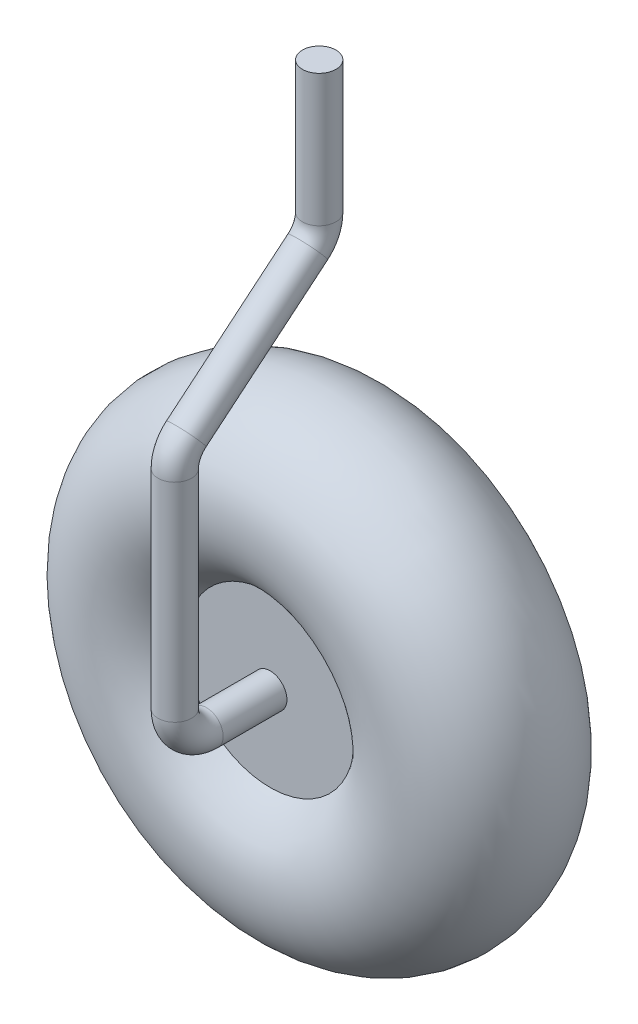
ISO-10303-21;
HEADER;
FILE_DESCRIPTION(('STEP AP214'),'2;1');
FILE_NAME('part.step','',(''),(''),'','','');
FILE_SCHEMA(('AUTOMOTIVE_DESIGN { 1 0 10303 214 1 1 1 1 }'));
ENDSEC;
DATA;
#1=APPLICATION_CONTEXT('core data for automotive mechanical design processes');
#2=APPLICATION_PROTOCOL_DEFINITION('international standard','automotive_design',2000,#1);
#3=PRODUCT_CONTEXT('',#1,'mechanical');
#4=PRODUCT('Part','Part','',(#3));
#5=PRODUCT_RELATED_PRODUCT_CATEGORY('part','',(#4));
#6=PRODUCT_DEFINITION_FORMATION('','',#4);
#7=PRODUCT_DEFINITION_CONTEXT('part definition',#1,'design');
#8=PRODUCT_DEFINITION('design','',#6,#7);
#9=PRODUCT_DEFINITION_SHAPE('','',#8);
#10=(LENGTH_UNIT() NAMED_UNIT(*) SI_UNIT(.MILLI.,.METRE.));
#11=(NAMED_UNIT(*) PLANE_ANGLE_UNIT() SI_UNIT($,.RADIAN.));
#12=(NAMED_UNIT(*) SI_UNIT($,.STERADIAN.) SOLID_ANGLE_UNIT());
#13=UNCERTAINTY_MEASURE_WITH_UNIT(LENGTH_MEASURE(1.E-05),#10,'distance_accuracy_value','');
#14=(GEOMETRIC_REPRESENTATION_CONTEXT(3) GLOBAL_UNCERTAINTY_ASSIGNED_CONTEXT((#13)) GLOBAL_UNIT_ASSIGNED_CONTEXT((#10,
#11,#12)) REPRESENTATION_CONTEXT('',''));
#15=CARTESIAN_POINT('',(0.,0.,0.));
#16=DIRECTION('',(0.,0.,1.));
#17=DIRECTION('',(1.,0.,0.));
#18=AXIS2_PLACEMENT_3D('',#15,#16,#17);
#19=CARTESIAN_POINT('',(0.,0.,0.));
#20=DIRECTION('',(0.,0.,-1.));
#21=DIRECTION('',(-1.,0.,0.));
#22=AXIS2_PLACEMENT_3D('',#19,#20,#21);
#23=TOROIDAL_SURFACE('',#22,12.2814251880284,6.76857481197165);
#24=CARTESIAN_POINT('',(0.,0.,3.93546071525525));
#25=DIRECTION('',(0.,0.,-1.));
#26=DIRECTION('',(-1.,0.,0.));
#27=AXIS2_PLACEMENT_3D('',#24,#25,#26);
#28=CIRCLE('',#27,6.77454277200205);
#29=CARTESIAN_POINT('',(-6.77454277200205,0.,3.93546071525525));
#30=VERTEX_POINT('',#29);
#31=EDGE_CURVE('E10',#30,#30,#28,.T.);
#32=ORIENTED_EDGE('',*,*,#31,.T.);
#33=EDGE_LOOP('',(#32));
#34=FACE_BOUND('',#33,.T.);
#35=CARTESIAN_POINT('',(0.,0.,-3.93546071525525));
#36=DIRECTION('',(0.,0.,-1.));
#37=DIRECTION('',(-1.,0.,0.));
#38=AXIS2_PLACEMENT_3D('',#35,#36,#37);
#39=CIRCLE('',#38,6.77454277200205);
#40=CARTESIAN_POINT('',(-6.77454277200205,0.,-3.93546071525525));
#41=VERTEX_POINT('',#40);
#42=EDGE_CURVE('E45',#41,#41,#39,.T.);
#43=ORIENTED_EDGE('',*,*,#42,.F.);
#44=EDGE_LOOP('',(#43));
#45=FACE_BOUND('',#44,.T.);
#46=ADVANCED_FACE('F39',(#34,#45),#23,.T.);
#47=CARTESIAN_POINT('',(0.,0.,3.93546071525525));
#48=DIRECTION('',(0.,0.,-1.));
#49=DIRECTION('',(-1.,0.,0.));
#50=AXIS2_PLACEMENT_3D('',#47,#48,#49);
#51=PLANE('',#50);
#52=CARTESIAN_POINT('',(0.,0.,3.93546071525525));
#53=DIRECTION('',(0.,0.,1.));
#54=DIRECTION('',(1.,0.,0.));
#55=AXIS2_PLACEMENT_3D('',#52,#53,#54);
#56=CIRCLE('',#55,1.34424002385664);
#57=CARTESIAN_POINT('',(1.34424002385664,0.,3.93546071525525));
#58=VERTEX_POINT('',#57);
#59=EDGE_CURVE('E73',#58,#58,#56,.T.);
#60=ORIENTED_EDGE('',*,*,#59,.F.);
#61=EDGE_LOOP('',(#60));
#62=FACE_BOUND('',#61,.T.);
#63=ORIENTED_EDGE('',*,*,#31,.F.);
#64=EDGE_LOOP('',(#63));
#65=FACE_BOUND('',#64,.T.);
#66=ADVANCED_FACE('F79',(#62,#65),#51,.F.);
#67=CARTESIAN_POINT('',(0.,0.,-3.93546071525525));
#68=DIRECTION('',(0.,0.,-1.));
#69=DIRECTION('',(-1.,0.,0.));
#70=AXIS2_PLACEMENT_3D('',#67,#68,#69);
#71=PLANE('',#70);
#72=ORIENTED_EDGE('',*,*,#42,.T.);
#73=EDGE_LOOP('',(#72));
#74=FACE_BOUND('',#73,.T.);
#75=ADVANCED_FACE('F82',(#74),#71,.T.);
#76=CARTESIAN_POINT('',(0.,41.860852469104,0.));
#77=DIRECTION('',(0.,1.,0.));
#78=DIRECTION('',(1.,0.,0.));
#79=AXIS2_PLACEMENT_3D('',#76,#77,#78);
#80=PLANE('',#79);
#81=CARTESIAN_POINT('',(0.,41.860852469104,0.));
#82=DIRECTION('',(0.,1.,0.));
#83=DIRECTION('',(1.,0.,0.));
#84=AXIS2_PLACEMENT_3D('',#81,#82,#83);
#85=CIRCLE('',#84,1.34424002385664);
#86=CARTESIAN_POINT('',(1.34424002385664,41.860852469104,0.));
#87=VERTEX_POINT('',#86);
#88=EDGE_CURVE('E49',#87,#87,#85,.T.);
#89=ORIENTED_EDGE('',*,*,#88,.T.);
#90=EDGE_LOOP('',(#89));
#91=FACE_BOUND('',#90,.T.);
#92=ADVANCED_FACE('F87',(#91),#80,.T.);
#93=CARTESIAN_POINT('',(0.,0.,3.93546071525525));
#94=DIRECTION('',(0.,0.,1.));
#95=DIRECTION('',(1.,0.,0.));
#96=AXIS2_PLACEMENT_3D('',#93,#94,#95);
#97=CYLINDRICAL_SURFACE('',#96,1.34424002385664);
#98=CARTESIAN_POINT('',(0.,0.,9.05051462373746));
#99=DIRECTION('',(0.,0.,1.));
#100=DIRECTION('',(1.,0.,0.));
#101=AXIS2_PLACEMENT_3D('',#98,#99,#100);
#102=CIRCLE('',#101,1.34424002385664);
#103=CARTESIAN_POINT('',(0.,-1.34424002385662,9.05051462373745));
#104=VERTEX_POINT('',#103);
#105=EDGE_CURVE('E70',#104,#104,#102,.T.);
#106=ORIENTED_EDGE('',*,*,#105,.F.);
#107=EDGE_LOOP('',(#106));
#108=FACE_BOUND('',#107,.T.);
#109=ORIENTED_EDGE('',*,*,#59,.T.);
#110=EDGE_LOOP('',(#109));
#111=FACE_BOUND('',#110,.T.);
#112=ADVANCED_FACE('F77',(#108,#111),#97,.T.);
#113=CARTESIAN_POINT('',(0.,2.54,9.05051462373748));
#114=DIRECTION('',(-1.,0.,0.));
#115=DIRECTION('',(0.,0.,1.));
#116=AXIS2_PLACEMENT_3D('',#113,#114,#115);
#117=TOROIDAL_SURFACE('',#116,2.53999999999997,1.34424002385664);
#118=CARTESIAN_POINT('',(0.,2.54,11.5905146237375));
#119=DIRECTION('',(0.,1.,0.));
#120=DIRECTION('',(1.,0.,0.));
#121=AXIS2_PLACEMENT_3D('',#118,#119,#120);
#122=CIRCLE('',#121,1.34424002385664);
#123=CARTESIAN_POINT('',(0.,2.54,12.9347546475941));
#124=VERTEX_POINT('',#123);
#125=EDGE_CURVE('E67',#124,#124,#122,.T.);
#126=CARTESIAN_POINT('',(0.,2.54,9.05051462373748));
#127=DIRECTION('',(-1.,0.,0.));
#128=DIRECTION('',(0.,0.,1.));
#129=AXIS2_PLACEMENT_3D('',#126,#127,#128);
#130=CIRCLE('',#129,3.88424002385662);
#131=EDGE_CURVE('',#104,#124,#130,.T.);
#132=ORIENTED_EDGE('',*,*,#105,.T.);
#133=ORIENTED_EDGE('',*,*,#125,.F.);
#134=ORIENTED_EDGE('',*,*,#131,.T.);
#135=ORIENTED_EDGE('',*,*,#131,.F.);
#136=EDGE_LOOP('',(#132,#134,#133,#135));
#137=FACE_BOUND('',#136,.T.);
#138=ADVANCED_FACE('F112',(#137),#117,.T.);
#139=CARTESIAN_POINT('',(0.,2.54,11.5905146237375));
#140=DIRECTION('',(0.,1.,0.));
#141=DIRECTION('',(0.,0.,1.));
#142=AXIS2_PLACEMENT_3D('',#139,#140,#141);
#143=CYLINDRICAL_SURFACE('',#142,1.34424002385664);
#144=CARTESIAN_POINT('',(0.,19.2278552592942,11.5905146237375));
#145=DIRECTION('',(0.,1.,0.));
#146=DIRECTION('',(1.,0.,0.));
#147=AXIS2_PLACEMENT_3D('',#144,#145,#146);
#148=CIRCLE('',#147,1.34424002385664);
#149=CARTESIAN_POINT('',(0.,19.2278552592942,12.9347546475941));
#150=VERTEX_POINT('',#149);
#151=EDGE_CURVE('E64',#150,#150,#148,.T.);
#152=ORIENTED_EDGE('',*,*,#151,.F.);
#153=EDGE_LOOP('',(#152));
#154=FACE_BOUND('',#153,.T.);
#155=ORIENTED_EDGE('',*,*,#125,.T.);
#156=EDGE_LOOP('',(#155));
#157=FACE_BOUND('',#156,.T.);
#158=ADVANCED_FACE('F108',(#154,#157),#143,.T.);
#159=CARTESIAN_POINT('',(0.,19.2278552592942,9.05051462373748));
#160=DIRECTION('',(-1.,0.,0.));
#161=DIRECTION('',(0.,0.,1.));
#162=AXIS2_PLACEMENT_3D('',#159,#160,#161);
#163=TOROIDAL_SURFACE('',#162,2.54,1.34424002385664);
#164=CARTESIAN_POINT('',(0.,21.17981580145,10.6757684629475));
#165=DIRECTION('',(0.,0.639863716224436,-0.76848840242352));
#166=DIRECTION('',(1.,0.,0.));
#167=AXIS2_PLACEMENT_3D('',#164,#165,#166);
#168=CIRCLE('',#167,1.34424002385664);
#169=CARTESIAN_POINT('',(0.,22.2128486698573,11.5358988801101));
#170=VERTEX_POINT('',#169);
#171=EDGE_CURVE('E61',#170,#170,#168,.T.);
#172=CARTESIAN_POINT('',(0.,19.2278552592942,9.05051462373748));
#173=DIRECTION('',(-1.,0.,0.));
#174=DIRECTION('',(0.,0.,1.));
#175=AXIS2_PLACEMENT_3D('',#172,#173,#174);
#176=CIRCLE('',#175,3.88424002385665);
#177=EDGE_CURVE('',#150,#170,#176,.T.);
#178=ORIENTED_EDGE('',*,*,#151,.T.);
#179=ORIENTED_EDGE('',*,*,#171,.F.);
#180=ORIENTED_EDGE('',*,*,#177,.T.);
#181=ORIENTED_EDGE('',*,*,#177,.F.);
#182=EDGE_LOOP('',(#178,#180,#179,#181));
#183=FACE_BOUND('',#182,.T.);
#184=ADVANCED_FACE('F104',(#183),#163,.T.);
#185=CARTESIAN_POINT('',(0.,21.17981580145,10.6757684629475));
#186=DIRECTION('',(0.,0.63986371622444,-0.768488402423517));
#187=DIRECTION('',(0.,0.768488402423517,0.63986371622444));
#188=AXIS2_PLACEMENT_3D('',#185,#186,#187);
#189=CYLINDRICAL_SURFACE('',#188,1.34424002385664);
#190=CARTESIAN_POINT('',(0.,29.3071004614547,0.914746160789931));
#191=DIRECTION('',(0.,0.63986371622444,-0.768488402423517));
#192=DIRECTION('',(1.,0.,0.));
#193=AXIS2_PLACEMENT_3D('',#190,#191,#192);
#194=CIRCLE('',#193,1.34424002385664);
#195=CARTESIAN_POINT('',(0.,28.2740675930474,0.0546157436273915));
#196=VERTEX_POINT('',#195);
#197=EDGE_CURVE('E58',#196,#196,#194,.T.);
#198=ORIENTED_EDGE('',*,*,#197,.F.);
#199=EDGE_LOOP('',(#198));
#200=FACE_BOUND('',#199,.T.);
#201=ORIENTED_EDGE('',*,*,#171,.T.);
#202=EDGE_LOOP('',(#201));
#203=FACE_BOUND('',#202,.T.);
#204=ADVANCED_FACE('F100',(#200,#203),#189,.T.);
#205=CARTESIAN_POINT('',(0.,31.2590610036105,2.54));
#206=DIRECTION('',(1.,0.,0.));
#207=DIRECTION('',(0.,0.,-1.));
#208=AXIS2_PLACEMENT_3D('',#205,#206,#207);
#209=TOROIDAL_SURFACE('',#208,2.54,1.34424002385664);
#210=CARTESIAN_POINT('',(0.,31.2590610036105,0.));
#211=DIRECTION('',(0.,1.,0.));
#212=DIRECTION('',(1.,0.,0.));
#213=AXIS2_PLACEMENT_3D('',#210,#211,#212);
#214=CIRCLE('',#213,1.34424002385664);
#215=CARTESIAN_POINT('',(0.,31.2590610036105,-1.34424002385665));
#216=VERTEX_POINT('',#215);
#217=EDGE_CURVE('E53',#216,#216,#214,.T.);
#218=CARTESIAN_POINT('',(0.,31.2590610036105,2.54));
#219=DIRECTION('',(1.,0.,0.));
#220=DIRECTION('',(0.,0.,-1.));
#221=AXIS2_PLACEMENT_3D('',#218,#219,#220);
#222=CIRCLE('',#221,3.88424002385665);
#223=EDGE_CURVE('',#196,#216,#222,.T.);
#224=ORIENTED_EDGE('',*,*,#197,.T.);
#225=ORIENTED_EDGE('',*,*,#217,.F.);
#226=ORIENTED_EDGE('',*,*,#223,.T.);
#227=ORIENTED_EDGE('',*,*,#223,.F.);
#228=EDGE_LOOP('',(#224,#226,#225,#227));
#229=FACE_BOUND('',#228,.T.);
#230=ADVANCED_FACE('F96',(#229),#209,.T.);
#231=CARTESIAN_POINT('',(0.,31.2590610036105,0.));
#232=DIRECTION('',(0.,1.,0.));
#233=DIRECTION('',(0.,0.,1.));
#234=AXIS2_PLACEMENT_3D('',#231,#232,#233);
#235=CYLINDRICAL_SURFACE('',#234,1.34424002385664);
#236=ORIENTED_EDGE('',*,*,#88,.F.);
#237=EDGE_LOOP('',(#236));
#238=FACE_BOUND('',#237,.T.);
#239=ORIENTED_EDGE('',*,*,#217,.T.);
#240=EDGE_LOOP('',(#239));
#241=FACE_BOUND('',#240,.T.);
#242=ADVANCED_FACE('F89',(#238,#241),#235,.T.);
#243=CLOSED_SHELL('',(#46,#66,#75,#92,#112,#138,#158,#184,#204,#230,#242));
#244=MANIFOLD_SOLID_BREP('B2',#243);
#245=ADVANCED_BREP_SHAPE_REPRESENTATION('',(#18,#244),#14);
#246=SHAPE_DEFINITION_REPRESENTATION(#9,#245);
ENDSEC;
END-ISO-10303-21;
